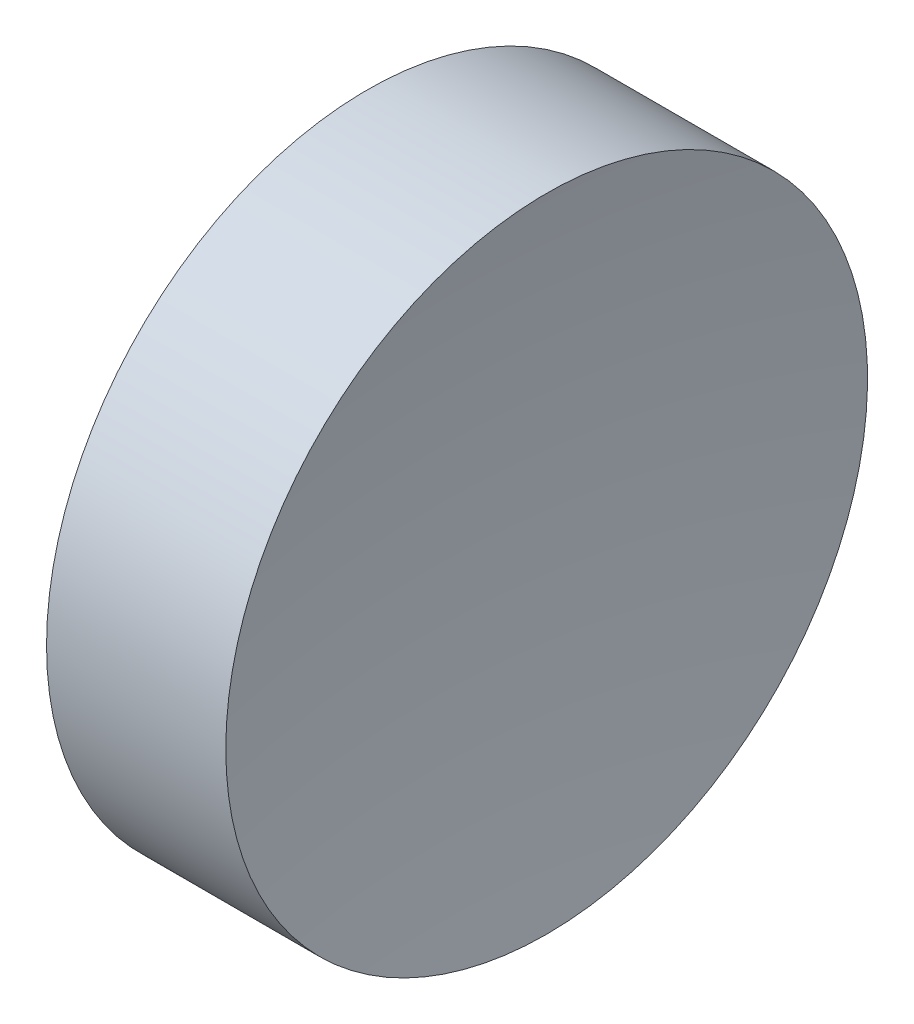
ISO-10303-21;
HEADER;
FILE_DESCRIPTION(('STEP AP214'),'2;1');
FILE_NAME('part.step','',(''),(''),'','','');
FILE_SCHEMA(('AUTOMOTIVE_DESIGN { 1 0 10303 214 1 1 1 1 }'));
ENDSEC;
DATA;
#1=APPLICATION_CONTEXT('core data for automotive mechanical design processes');
#2=APPLICATION_PROTOCOL_DEFINITION('international standard','automotive_design',2000,#1);
#3=PRODUCT_CONTEXT('',#1,'mechanical');
#4=PRODUCT('Part','Part','',(#3));
#5=PRODUCT_RELATED_PRODUCT_CATEGORY('part','',(#4));
#6=PRODUCT_DEFINITION_FORMATION('','',#4);
#7=PRODUCT_DEFINITION_CONTEXT('part definition',#1,'design');
#8=PRODUCT_DEFINITION('design','',#6,#7);
#9=PRODUCT_DEFINITION_SHAPE('','',#8);
#10=(LENGTH_UNIT() NAMED_UNIT(*) SI_UNIT(.MILLI.,.METRE.));
#11=(NAMED_UNIT(*) PLANE_ANGLE_UNIT() SI_UNIT($,.RADIAN.));
#12=(NAMED_UNIT(*) SI_UNIT($,.STERADIAN.) SOLID_ANGLE_UNIT());
#13=UNCERTAINTY_MEASURE_WITH_UNIT(LENGTH_MEASURE(1.E-05),#10,'distance_accuracy_value','');
#14=(GEOMETRIC_REPRESENTATION_CONTEXT(3) GLOBAL_UNCERTAINTY_ASSIGNED_CONTEXT((#13)) GLOBAL_UNIT_ASSIGNED_CONTEXT((#10,
#11,#12)) REPRESENTATION_CONTEXT('',''));
#15=CARTESIAN_POINT('',(0.,0.,0.));
#16=DIRECTION('',(0.,0.,1.));
#17=DIRECTION('',(1.,0.,0.));
#18=AXIS2_PLACEMENT_3D('',#15,#16,#17);
#19=CARTESIAN_POINT('',(201.09266922369,69.3780211233725,0.));
#20=DIRECTION('',(-1.,0.,0.));
#21=DIRECTION('',(0.,-1.,0.));
#22=AXIS2_PLACEMENT_3D('',#19,#20,#21);
#23=SPHERICAL_SURFACE('',#22,80.);
#24=CARTESIAN_POINT('',(122.075266077295,69.3780211233724,0.));
#25=DIRECTION('',(-1.,0.,0.));
#26=DIRECTION('',(0.,0.,1.));
#27=AXIS2_PLACEMENT_3D('',#24,#25,#26);
#28=CIRCLE('',#27,12.5);
#29=CARTESIAN_POINT('',(122.075266077295,69.3780211233724,12.5));
#30=VERTEX_POINT('',#29);
#31=EDGE_CURVE('E10',#30,#30,#28,.T.);
#32=ORIENTED_EDGE('',*,*,#31,.F.);
#33=EDGE_LOOP('',(#32));
#34=FACE_BOUND('',#33,.T.);
#35=ADVANCED_FACE('F35',(#34),#23,.F.);
#36=CARTESIAN_POINT('',(108.985143002165,69.3780211233724,0.));
#37=DIRECTION('',(-1.,0.,0.));
#38=DIRECTION('',(0.,0.,1.));
#39=AXIS2_PLACEMENT_3D('',#36,#37,#38);
#40=CYLINDRICAL_SURFACE('',#39,12.5);
#41=CARTESIAN_POINT('',(115.09265553492,69.3780211233724,0.));
#42=DIRECTION('',(-1.,0.,0.));
#43=DIRECTION('',(0.,0.,1.));
#44=AXIS2_PLACEMENT_3D('',#41,#42,#43);
#45=CIRCLE('',#44,12.5);
#46=CARTESIAN_POINT('',(115.09265553492,69.3780211233724,12.5));
#47=VERTEX_POINT('',#46);
#48=EDGE_CURVE('E41',#47,#47,#45,.T.);
#49=ORIENTED_EDGE('',*,*,#48,.F.);
#50=EDGE_LOOP('',(#49));
#51=FACE_BOUND('',#50,.T.);
#52=ORIENTED_EDGE('',*,*,#31,.T.);
#53=EDGE_LOOP('',(#52));
#54=FACE_BOUND('',#53,.T.);
#55=ADVANCED_FACE('F49',(#51,#54),#40,.T.);
#56=CARTESIAN_POINT('',(115.09265553492,69.3780211233724,0.));
#57=DIRECTION('',(1.,0.,0.));
#58=DIRECTION('',(0.,0.,-1.));
#59=AXIS2_PLACEMENT_3D('',#56,#57,#58);
#60=PLANE('',#59);
#61=ORIENTED_EDGE('',*,*,#48,.T.);
#62=EDGE_LOOP('',(#61));
#63=FACE_BOUND('',#62,.T.);
#64=ADVANCED_FACE('F47',(#63),#60,.F.);
#65=CLOSED_SHELL('',(#35,#55,#64));
#66=MANIFOLD_SOLID_BREP('B2',#65);
#67=ADVANCED_BREP_SHAPE_REPRESENTATION('',(#18,#66),#14);
#68=SHAPE_DEFINITION_REPRESENTATION(#9,#67);
ENDSEC;
END-ISO-10303-21;
